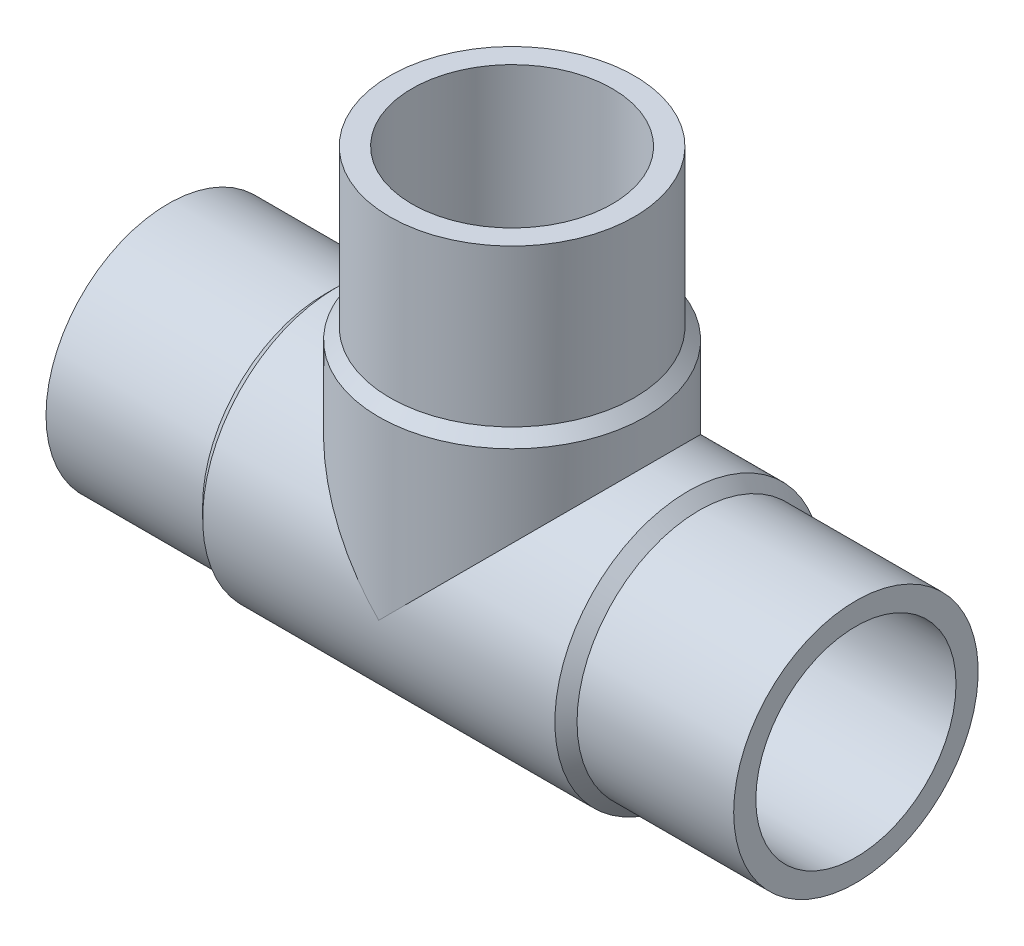
ISO-10303-21;
HEADER;
FILE_DESCRIPTION(('STEP AP214'),'2;1');
FILE_NAME('part.step','',(''),(''),'','','');
FILE_SCHEMA(('AUTOMOTIVE_DESIGN { 1 0 10303 214 1 1 1 1 }'));
ENDSEC;
DATA;
#1=APPLICATION_CONTEXT('core data for automotive mechanical design processes');
#2=APPLICATION_PROTOCOL_DEFINITION('international standard','automotive_design',2000,#1);
#3=PRODUCT_CONTEXT('',#1,'mechanical');
#4=PRODUCT('Part','Part','',(#3));
#5=PRODUCT_RELATED_PRODUCT_CATEGORY('part','',(#4));
#6=PRODUCT_DEFINITION_FORMATION('','',#4);
#7=PRODUCT_DEFINITION_CONTEXT('part definition',#1,'design');
#8=PRODUCT_DEFINITION('design','',#6,#7);
#9=PRODUCT_DEFINITION_SHAPE('','',#8);
#10=(LENGTH_UNIT() NAMED_UNIT(*) SI_UNIT(.MILLI.,.METRE.));
#11=(NAMED_UNIT(*) PLANE_ANGLE_UNIT() SI_UNIT($,.RADIAN.));
#12=(NAMED_UNIT(*) SI_UNIT($,.STERADIAN.) SOLID_ANGLE_UNIT());
#13=UNCERTAINTY_MEASURE_WITH_UNIT(LENGTH_MEASURE(1.E-05),#10,'distance_accuracy_value','');
#14=(GEOMETRIC_REPRESENTATION_CONTEXT(3) GLOBAL_UNCERTAINTY_ASSIGNED_CONTEXT((#13)) GLOBAL_UNIT_ASSIGNED_CONTEXT((#10,
#11,#12)) REPRESENTATION_CONTEXT('',''));
#15=CARTESIAN_POINT('',(0.,0.,0.));
#16=DIRECTION('',(0.,0.,1.));
#17=DIRECTION('',(1.,0.,0.));
#18=AXIS2_PLACEMENT_3D('',#15,#16,#17);
#19=CARTESIAN_POINT('',(-45.,45.,0.));
#20=DIRECTION('',(0.,1.,0.));
#21=DIRECTION('',(0.,0.,1.));
#22=AXIS2_PLACEMENT_3D('',#19,#20,#21);
#23=CYLINDRICAL_SURFACE('',#22,16.);
#24=CARTESIAN_POINT('',(-45.,45.,0.));
#25=DIRECTION('',(0.,1.,0.));
#26=DIRECTION('',(0.,0.,1.));
#27=AXIS2_PLACEMENT_3D('',#24,#25,#26);
#28=CIRCLE('',#27,16.);
#29=CARTESIAN_POINT('',(-45.,45.,16.));
#30=VERTEX_POINT('',#29);
#31=EDGE_CURVE('E18',#30,#30,#28,.T.);
#32=ORIENTED_EDGE('',*,*,#31,.F.);
#33=EDGE_LOOP('',(#32));
#34=FACE_BOUND('',#33,.T.);
#35=CARTESIAN_POINT('',(-45.,24.5,0.));
#36=DIRECTION('',(0.,1.,0.));
#37=DIRECTION('',(1.,0.,0.));
#38=AXIS2_PLACEMENT_3D('',#35,#36,#37);
#39=CIRCLE('',#38,16.);
#40=CARTESIAN_POINT('',(-29.,24.5,0.));
#41=VERTEX_POINT('',#40);
#42=EDGE_CURVE('E71',#41,#41,#39,.F.);
#43=ORIENTED_EDGE('',*,*,#42,.F.);
#44=EDGE_LOOP('',(#43));
#45=FACE_BOUND('',#44,.T.);
#46=ADVANCED_FACE('F15',(#34,#45),#23,.T.);
#47=CARTESIAN_POINT('',(-45.,24.5,0.));
#48=DIRECTION('',(0.,-1.,0.));
#49=DIRECTION('',(0.,0.,-1.));
#50=AXIS2_PLACEMENT_3D('',#47,#48,#49);
#51=CONICAL_SURFACE('',#50,16.,0.785398163397452);
#52=CARTESIAN_POINT('',(-45.,23.05,0.));
#53=DIRECTION('',(0.,1.,0.));
#54=DIRECTION('',(1.,0.,0.));
#55=AXIS2_PLACEMENT_3D('',#52,#53,#54);
#56=CIRCLE('',#55,17.45);
#57=CARTESIAN_POINT('',(-27.55,23.05,0.));
#58=VERTEX_POINT('',#57);
#59=EDGE_CURVE('E60',#58,#58,#56,.F.);
#60=ORIENTED_EDGE('',*,*,#59,.F.);
#61=EDGE_LOOP('',(#60));
#62=FACE_BOUND('',#61,.T.);
#63=ORIENTED_EDGE('',*,*,#42,.T.);
#64=EDGE_LOOP('',(#63));
#65=FACE_BOUND('',#64,.T.);
#66=ADVANCED_FACE('F141',(#62,#65),#51,.T.);
#67=CARTESIAN_POINT('',(-20.5,0.,0.));
#68=DIRECTION('',(-1.,0.,0.));
#69=DIRECTION('',(0.,0.,1.));
#70=AXIS2_PLACEMENT_3D('',#67,#68,#69);
#71=CYLINDRICAL_SURFACE('',#70,16.);
#72=CARTESIAN_POINT('',(-20.5,0.,0.));
#73=DIRECTION('',(1.,0.,0.));
#74=DIRECTION('',(0.,1.,0.));
#75=AXIS2_PLACEMENT_3D('',#72,#73,#74);
#76=CIRCLE('',#75,16.);
#77=CARTESIAN_POINT('',(-20.5,16.,0.));
#78=VERTEX_POINT('',#77);
#79=EDGE_CURVE('E64',#78,#78,#76,.F.);
#80=ORIENTED_EDGE('',*,*,#79,.F.);
#81=EDGE_LOOP('',(#80));
#82=FACE_BOUND('',#81,.T.);
#83=CARTESIAN_POINT('',(0.,0.,0.));
#84=DIRECTION('',(-1.,0.,0.));
#85=DIRECTION('',(0.,0.,1.));
#86=AXIS2_PLACEMENT_3D('',#83,#84,#85);
#87=CIRCLE('',#86,16.);
#88=CARTESIAN_POINT('',(0.,0.,16.));
#89=VERTEX_POINT('',#88);
#90=EDGE_CURVE('E58',#89,#89,#87,.F.);
#91=ORIENTED_EDGE('',*,*,#90,.F.);
#92=EDGE_LOOP('',(#91));
#93=FACE_BOUND('',#92,.T.);
#94=ADVANCED_FACE('F136',(#82,#93),#71,.T.);
#95=CARTESIAN_POINT('',(-61.,45.,16.192002108351));
#96=DIRECTION('',(0.,1.,0.));
#97=DIRECTION('',(1.,0.,0.));
#98=AXIS2_PLACEMENT_3D('',#95,#96,#97);
#99=PLANE('',#98);
#100=CARTESIAN_POINT('',(-45.,45.,0.));
#101=DIRECTION('',(0.,1.,0.));
#102=DIRECTION('',(0.,0.,1.));
#103=AXIS2_PLACEMENT_3D('',#100,#101,#102);
#104=CIRCLE('',#103,13.1);
#105=CARTESIAN_POINT('',(-45.,45.,13.1));
#106=VERTEX_POINT('',#105);
#107=EDGE_CURVE('E52',#106,#106,#104,.T.);
#108=ORIENTED_EDGE('',*,*,#107,.F.);
#109=EDGE_LOOP('',(#108));
#110=FACE_BOUND('',#109,.T.);
#111=ORIENTED_EDGE('',*,*,#31,.T.);
#112=EDGE_LOOP('',(#111));
#113=FACE_BOUND('',#112,.T.);
#114=ADVANCED_FACE('F130',(#110,#113),#99,.T.);
#115=CARTESIAN_POINT('',(-20.5,0.,0.));
#116=DIRECTION('',(-1.,0.,0.));
#117=DIRECTION('',(0.,0.,1.));
#118=AXIS2_PLACEMENT_3D('',#115,#116,#117);
#119=CONICAL_SURFACE('',#118,16.,0.785398163397441);
#120=ORIENTED_EDGE('',*,*,#79,.T.);
#121=EDGE_LOOP('',(#120));
#122=FACE_BOUND('',#121,.T.);
#123=CARTESIAN_POINT('',(-21.95,0.,0.));
#124=DIRECTION('',(-1.,0.,0.));
#125=DIRECTION('',(0.,1.,0.));
#126=AXIS2_PLACEMENT_3D('',#123,#124,#125);
#127=CIRCLE('',#126,17.45);
#128=CARTESIAN_POINT('',(-21.95,17.45,0.));
#129=VERTEX_POINT('',#128);
#130=EDGE_CURVE('E49',#129,#129,#127,.T.);
#131=ORIENTED_EDGE('',*,*,#130,.F.);
#132=EDGE_LOOP('',(#131));
#133=FACE_BOUND('',#132,.T.);
#134=ADVANCED_FACE('F95',(#122,#133),#119,.T.);
#135=CARTESIAN_POINT('',(-45.,23.05,0.));
#136=DIRECTION('',(0.,1.,0.));
#137=DIRECTION('',(0.,0.,1.));
#138=AXIS2_PLACEMENT_3D('',#135,#136,#137);
#139=CYLINDRICAL_SURFACE('',#138,17.45);
#140=CARTESIAN_POINT('',(-45.,0.,0.));
#141=DIRECTION('',(0.707106781186547,0.707106781186547,0.));
#142=DIRECTION('',(-0.707106781186547,0.707106781186547,0.));
#143=AXIS2_PLACEMENT_3D('',#140,#141,#142);
#144=ELLIPSE('',#143,24.6780266634105,17.45);
#145=CARTESIAN_POINT('',(-45.,0.,17.45));
#146=VERTEX_POINT('',#145);
#147=CARTESIAN_POINT('',(-45.,0.,-17.45));
#148=VERTEX_POINT('',#147);
#149=EDGE_CURVE('E44',#146,#148,#144,.F.);
#150=ORIENTED_EDGE('',*,*,#149,.F.);
#151=CARTESIAN_POINT('',(-45.,0.,0.));
#152=DIRECTION('',(-0.707106781186547,0.707106781186547,0.));
#153=DIRECTION('',(-0.707106781186547,-0.707106781186547,0.));
#154=AXIS2_PLACEMENT_3D('',#151,#152,#153);
#155=ELLIPSE('',#154,24.6780266634105,17.45);
#156=EDGE_CURVE('E40',#148,#146,#155,.F.);
#157=ORIENTED_EDGE('',*,*,#156,.F.);
#158=EDGE_LOOP('',(#150,#157));
#159=FACE_BOUND('',#158,.T.);
#160=ORIENTED_EDGE('',*,*,#59,.T.);
#161=EDGE_LOOP('',(#160));
#162=FACE_BOUND('',#161,.T.);
#163=ADVANCED_FACE('F47',(#159,#162),#139,.T.);
#164=CARTESIAN_POINT('',(0.,16.,16.1920021082986));
#165=DIRECTION('',(1.,0.,0.));
#166=DIRECTION('',(0.,-1.,0.));
#167=AXIS2_PLACEMENT_3D('',#164,#165,#166);
#168=PLANE('',#167);
#169=CARTESIAN_POINT('',(0.,0.,0.));
#170=DIRECTION('',(-1.,0.,0.));
#171=DIRECTION('',(0.,0.,1.));
#172=AXIS2_PLACEMENT_3D('',#169,#170,#171);
#173=CIRCLE('',#172,13.1);
#174=CARTESIAN_POINT('',(0.,0.,13.1));
#175=VERTEX_POINT('',#174);
#176=EDGE_CURVE('E45',#175,#175,#173,.F.);
#177=ORIENTED_EDGE('',*,*,#176,.F.);
#178=EDGE_LOOP('',(#177));
#179=FACE_BOUND('',#178,.T.);
#180=ORIENTED_EDGE('',*,*,#90,.T.);
#181=EDGE_LOOP('',(#180));
#182=FACE_BOUND('',#181,.T.);
#183=ADVANCED_FACE('F85',(#179,#182),#168,.T.);
#184=CARTESIAN_POINT('',(-45.,0.,0.));
#185=DIRECTION('',(0.,1.,0.));
#186=DIRECTION('',(0.,0.,1.));
#187=AXIS2_PLACEMENT_3D('',#184,#185,#186);
#188=CYLINDRICAL_SURFACE('',#187,13.1);
#189=CARTESIAN_POINT('',(-45.,0.,0.));
#190=DIRECTION('',(-0.707106781186547,-0.707106781186547,0.));
#191=DIRECTION('',(-0.707106781186547,0.707106781186547,0.));
#192=AXIS2_PLACEMENT_3D('',#189,#190,#191);
#193=ELLIPSE('',#192,18.5261976670875,13.1);
#194=CARTESIAN_POINT('',(-45.,0.,-13.1));
#195=VERTEX_POINT('',#194);
#196=CARTESIAN_POINT('',(-45.,0.,13.1));
#197=VERTEX_POINT('',#196);
#198=EDGE_CURVE('E78',#195,#197,#193,.F.);
#199=ORIENTED_EDGE('',*,*,#198,.F.);
#200=CARTESIAN_POINT('',(-45.,0.,0.));
#201=DIRECTION('',(-0.707106781186547,0.707106781186547,0.));
#202=DIRECTION('',(0.707106781186547,0.707106781186547,0.));
#203=AXIS2_PLACEMENT_3D('',#200,#201,#202);
#204=ELLIPSE('',#203,18.5261976670875,13.1);
#205=EDGE_CURVE('E32',#195,#197,#204,.F.);
#206=ORIENTED_EDGE('',*,*,#205,.T.);
#207=EDGE_LOOP('',(#199,#206));
#208=FACE_BOUND('',#207,.T.);
#209=ORIENTED_EDGE('',*,*,#107,.T.);
#210=EDGE_LOOP('',(#209));
#211=FACE_BOUND('',#210,.T.);
#212=ADVANCED_FACE('F87',(#208,#211),#188,.F.);
#213=CARTESIAN_POINT('',(-68.05,0.,0.));
#214=DIRECTION('',(-1.,0.,0.));
#215=DIRECTION('',(0.,0.,1.));
#216=AXIS2_PLACEMENT_3D('',#213,#214,#215);
#217=CYLINDRICAL_SURFACE('',#216,17.45);
#218=ORIENTED_EDGE('',*,*,#130,.T.);
#219=EDGE_LOOP('',(#218));
#220=FACE_BOUND('',#219,.T.);
#221=CARTESIAN_POINT('',(-68.05,0.,0.));
#222=DIRECTION('',(-1.,0.,0.));
#223=DIRECTION('',(0.,1.,0.));
#224=AXIS2_PLACEMENT_3D('',#221,#222,#223);
#225=CIRCLE('',#224,17.45);
#226=CARTESIAN_POINT('',(-68.05,17.45,0.));
#227=VERTEX_POINT('',#226);
#228=EDGE_CURVE('E77',#227,#227,#225,.T.);
#229=ORIENTED_EDGE('',*,*,#228,.F.);
#230=EDGE_LOOP('',(#229));
#231=FACE_BOUND('',#230,.T.);
#232=ORIENTED_EDGE('',*,*,#149,.T.);
#233=ORIENTED_EDGE('',*,*,#156,.T.);
#234=EDGE_LOOP('',(#232,#233));
#235=FACE_BOUND('',#234,.T.);
#236=ADVANCED_FACE('F43',(#220,#231,#235),#217,.T.);
#237=CARTESIAN_POINT('',(-45.,0.,0.));
#238=DIRECTION('',(-1.,0.,0.));
#239=DIRECTION('',(0.,0.,1.));
#240=AXIS2_PLACEMENT_3D('',#237,#238,#239);
#241=CYLINDRICAL_SURFACE('',#240,13.1);
#242=ORIENTED_EDGE('',*,*,#205,.F.);
#243=ORIENTED_EDGE('',*,*,#198,.T.);
#244=EDGE_LOOP('',(#242,#243));
#245=FACE_BOUND('',#244,.T.);
#246=ORIENTED_EDGE('',*,*,#176,.T.);
#247=EDGE_LOOP('',(#246));
#248=FACE_BOUND('',#247,.T.);
#249=CARTESIAN_POINT('',(-90.,0.,0.));
#250=DIRECTION('',(-1.,0.,0.));
#251=DIRECTION('',(0.,0.,1.));
#252=AXIS2_PLACEMENT_3D('',#249,#250,#251);
#253=CIRCLE('',#252,13.1);
#254=CARTESIAN_POINT('',(-90.,0.,13.1));
#255=VERTEX_POINT('',#254);
#256=EDGE_CURVE('E74',#255,#255,#253,.F.);
#257=ORIENTED_EDGE('',*,*,#256,.F.);
#258=EDGE_LOOP('',(#257));
#259=FACE_BOUND('',#258,.T.);
#260=ADVANCED_FACE('F82',(#245,#248,#259),#241,.F.);
#261=CARTESIAN_POINT('',(-69.5,0.,0.));
#262=DIRECTION('',(1.,0.,0.));
#263=DIRECTION('',(0.,0.,-1.));
#264=AXIS2_PLACEMENT_3D('',#261,#262,#263);
#265=CONICAL_SURFACE('',#264,16.,0.785398163397446);
#266=ORIENTED_EDGE('',*,*,#228,.T.);
#267=EDGE_LOOP('',(#266));
#268=FACE_BOUND('',#267,.T.);
#269=CARTESIAN_POINT('',(-69.5,0.,0.));
#270=DIRECTION('',(-1.,0.,0.));
#271=DIRECTION('',(0.,1.,0.));
#272=AXIS2_PLACEMENT_3D('',#269,#270,#271);
#273=CIRCLE('',#272,16.);
#274=CARTESIAN_POINT('',(-69.5,16.,0.));
#275=VERTEX_POINT('',#274);
#276=EDGE_CURVE('E24',#275,#275,#273,.T.);
#277=ORIENTED_EDGE('',*,*,#276,.F.);
#278=EDGE_LOOP('',(#277));
#279=FACE_BOUND('',#278,.T.);
#280=ADVANCED_FACE('F105',(#268,#279),#265,.T.);
#281=CARTESIAN_POINT('',(-90.,-16.,16.1920021084034));
#282=DIRECTION('',(-1.,0.,0.));
#283=DIRECTION('',(0.,1.,0.));
#284=AXIS2_PLACEMENT_3D('',#281,#282,#283);
#285=PLANE('',#284);
#286=ORIENTED_EDGE('',*,*,#256,.T.);
#287=EDGE_LOOP('',(#286));
#288=FACE_BOUND('',#287,.T.);
#289=CARTESIAN_POINT('',(-90.,0.,0.));
#290=DIRECTION('',(-1.,0.,0.));
#291=DIRECTION('',(0.,0.,1.));
#292=AXIS2_PLACEMENT_3D('',#289,#290,#291);
#293=CIRCLE('',#292,16.);
#294=CARTESIAN_POINT('',(-90.,0.,16.));
#295=VERTEX_POINT('',#294);
#296=EDGE_CURVE('E9',#295,#295,#293,.F.);
#297=ORIENTED_EDGE('',*,*,#296,.F.);
#298=EDGE_LOOP('',(#297));
#299=FACE_BOUND('',#298,.T.);
#300=ADVANCED_FACE('F99',(#288,#299),#285,.T.);
#301=CARTESIAN_POINT('',(-90.,0.,0.));
#302=DIRECTION('',(-1.,0.,0.));
#303=DIRECTION('',(0.,0.,1.));
#304=AXIS2_PLACEMENT_3D('',#301,#302,#303);
#305=CYLINDRICAL_SURFACE('',#304,16.);
#306=ORIENTED_EDGE('',*,*,#276,.T.);
#307=EDGE_LOOP('',(#306));
#308=FACE_BOUND('',#307,.T.);
#309=ORIENTED_EDGE('',*,*,#296,.T.);
#310=EDGE_LOOP('',(#309));
#311=FACE_BOUND('',#310,.T.);
#312=ADVANCED_FACE('F97',(#308,#311),#305,.T.);
#313=CLOSED_SHELL('',(#46,#66,#94,#114,#134,#163,#183,#212,#236,#260,#280,#300,#312));
#314=MANIFOLD_SOLID_BREP('B1',#313);
#315=ADVANCED_BREP_SHAPE_REPRESENTATION('',(#18,#314),#14);
#316=SHAPE_DEFINITION_REPRESENTATION(#9,#315);
ENDSEC;
END-ISO-10303-21;
